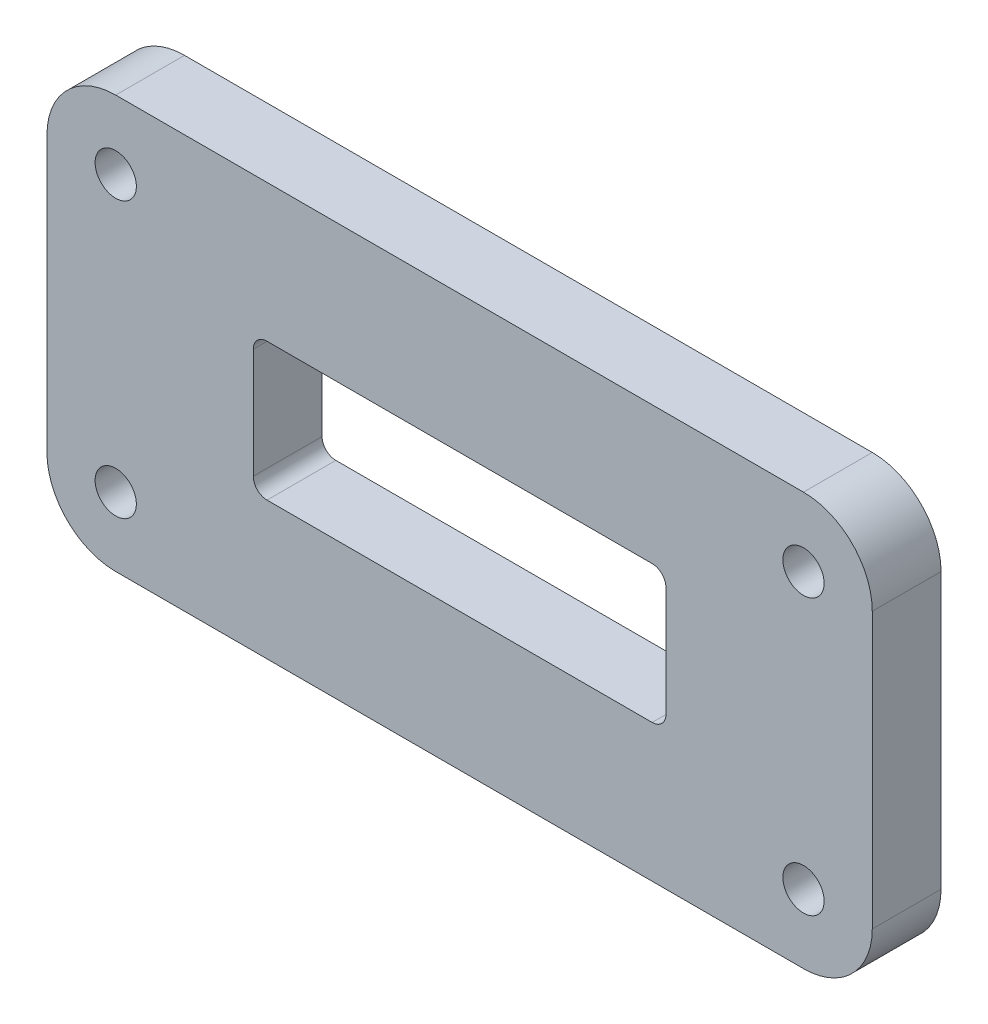
ISO-10303-21;
HEADER;
FILE_DESCRIPTION(('STEP AP214'),'2;1');
FILE_NAME('part.step','',(''),(''),'','','');
FILE_SCHEMA(('AUTOMOTIVE_DESIGN { 1 0 10303 214 1 1 1 1 }'));
ENDSEC;
DATA;
#1=APPLICATION_CONTEXT('core data for automotive mechanical design processes');
#2=APPLICATION_PROTOCOL_DEFINITION('international standard','automotive_design',2000,#1);
#3=PRODUCT_CONTEXT('',#1,'mechanical');
#4=PRODUCT('Part','Part','',(#3));
#5=PRODUCT_RELATED_PRODUCT_CATEGORY('part','',(#4));
#6=PRODUCT_DEFINITION_FORMATION('','',#4);
#7=PRODUCT_DEFINITION_CONTEXT('part definition',#1,'design');
#8=PRODUCT_DEFINITION('design','',#6,#7);
#9=PRODUCT_DEFINITION_SHAPE('','',#8);
#10=(LENGTH_UNIT() NAMED_UNIT(*) SI_UNIT(.MILLI.,.METRE.));
#11=(NAMED_UNIT(*) PLANE_ANGLE_UNIT() SI_UNIT($,.RADIAN.));
#12=(NAMED_UNIT(*) SI_UNIT($,.STERADIAN.) SOLID_ANGLE_UNIT());
#13=UNCERTAINTY_MEASURE_WITH_UNIT(LENGTH_MEASURE(1.E-05),#10,'distance_accuracy_value','');
#14=(GEOMETRIC_REPRESENTATION_CONTEXT(3) GLOBAL_UNCERTAINTY_ASSIGNED_CONTEXT((#13)) GLOBAL_UNIT_ASSIGNED_CONTEXT((#10,
#11,#12)) REPRESENTATION_CONTEXT('',''));
#15=CARTESIAN_POINT('',(0.,0.,0.));
#16=DIRECTION('',(0.,0.,1.));
#17=DIRECTION('',(1.,0.,0.));
#18=AXIS2_PLACEMENT_3D('',#15,#16,#17);
#19=CARTESIAN_POINT('',(25.,10.,5.));
#20=DIRECTION('',(0.,0.,1.));
#21=DIRECTION('',(1.,0.,0.));
#22=AXIS2_PLACEMENT_3D('',#19,#20,#21);
#23=PLANE('',#22);
#24=CARTESIAN_POINT('',(25.,-10.,5.));
#25=DIRECTION('',(0.,0.,1.));
#26=DIRECTION('',(1.,0.,0.));
#27=AXIS2_PLACEMENT_3D('',#24,#25,#26);
#28=CIRCLE('',#27,1.5);
#29=CARTESIAN_POINT('',(26.5,-10.,5.));
#30=VERTEX_POINT('',#29);
#31=EDGE_CURVE('E389',#30,#30,#28,.T.);
#32=ORIENTED_EDGE('',*,*,#31,.F.);
#33=EDGE_LOOP('',(#32));
#34=FACE_BOUND('',#33,.T.);
#35=CARTESIAN_POINT('',(-25.,9.99999999999999,5.));
#36=DIRECTION('',(0.,0.,1.));
#37=DIRECTION('',(1.,0.,0.));
#38=AXIS2_PLACEMENT_3D('',#35,#36,#37);
#39=CIRCLE('',#38,1.5);
#40=CARTESIAN_POINT('',(-23.5,9.99999999999999,5.));
#41=VERTEX_POINT('',#40);
#42=EDGE_CURVE('E184',#41,#41,#39,.T.);
#43=ORIENTED_EDGE('',*,*,#42,.F.);
#44=EDGE_LOOP('',(#43));
#45=FACE_BOUND('',#44,.T.);
#46=CARTESIAN_POINT('',(25.,10.,5.));
#47=DIRECTION('',(0.,0.,1.));
#48=DIRECTION('',(1.,0.,0.));
#49=AXIS2_PLACEMENT_3D('',#46,#47,#48);
#50=CIRCLE('',#49,4.99999999999999);
#51=CARTESIAN_POINT('',(30.,10.,5.));
#52=VERTEX_POINT('',#51);
#53=CARTESIAN_POINT('',(25.,15.,5.));
#54=VERTEX_POINT('',#53);
#55=EDGE_CURVE('E214',#52,#54,#50,.T.);
#56=ORIENTED_EDGE('',*,*,#55,.T.);
#57=DIRECTION('',(-1.,0.,0.));
#58=VECTOR('',#57,1.);
#59=CARTESIAN_POINT('',(25.,15.,5.));
#60=LINE('',#59,#58);
#61=CARTESIAN_POINT('',(-25.,15.,5.));
#62=VERTEX_POINT('',#61);
#63=EDGE_CURVE('E217',#54,#62,#60,.T.);
#64=ORIENTED_EDGE('',*,*,#63,.T.);
#65=CARTESIAN_POINT('',(-25.,9.99999999999999,5.));
#66=DIRECTION('',(0.,0.,1.));
#67=DIRECTION('',(1.,0.,0.));
#68=AXIS2_PLACEMENT_3D('',#65,#66,#67);
#69=CIRCLE('',#68,5.);
#70=CARTESIAN_POINT('',(-30.,9.99999999999999,5.));
#71=VERTEX_POINT('',#70);
#72=EDGE_CURVE('E220',#62,#71,#69,.T.);
#73=ORIENTED_EDGE('',*,*,#72,.T.);
#74=DIRECTION('',(0.,-1.,0.));
#75=VECTOR('',#74,1.);
#76=CARTESIAN_POINT('',(-30.,-10.,5.));
#77=LINE('',#76,#75);
#78=CARTESIAN_POINT('',(-30.,-10.,5.));
#79=VERTEX_POINT('',#78);
#80=EDGE_CURVE('E222',#71,#79,#77,.T.);
#81=ORIENTED_EDGE('',*,*,#80,.T.);
#82=CARTESIAN_POINT('',(-25.,-10.,5.));
#83=DIRECTION('',(0.,0.,1.));
#84=DIRECTION('',(1.,0.,0.));
#85=AXIS2_PLACEMENT_3D('',#82,#83,#84);
#86=CIRCLE('',#85,5.);
#87=CARTESIAN_POINT('',(-25.,-15.,5.));
#88=VERTEX_POINT('',#87);
#89=EDGE_CURVE('E224',#79,#88,#86,.T.);
#90=ORIENTED_EDGE('',*,*,#89,.T.);
#91=DIRECTION('',(1.,0.,0.));
#92=VECTOR('',#91,1.);
#93=CARTESIAN_POINT('',(25.,-15.,5.));
#94=LINE('',#93,#92);
#95=CARTESIAN_POINT('',(25.,-15.,5.));
#96=VERTEX_POINT('',#95);
#97=EDGE_CURVE('E226',#88,#96,#94,.T.);
#98=ORIENTED_EDGE('',*,*,#97,.T.);
#99=CARTESIAN_POINT('',(25.,-10.,5.));
#100=DIRECTION('',(0.,0.,1.));
#101=DIRECTION('',(1.,0.,0.));
#102=AXIS2_PLACEMENT_3D('',#99,#100,#101);
#103=CIRCLE('',#102,4.99999999999999);
#104=CARTESIAN_POINT('',(30.,-10.,5.));
#105=VERTEX_POINT('',#104);
#106=EDGE_CURVE('E228',#96,#105,#103,.T.);
#107=ORIENTED_EDGE('',*,*,#106,.T.);
#108=DIRECTION('',(0.,1.,0.));
#109=VECTOR('',#108,1.);
#110=CARTESIAN_POINT('',(30.,-10.,5.));
#111=LINE('',#110,#109);
#112=EDGE_CURVE('E230',#105,#52,#111,.T.);
#113=ORIENTED_EDGE('',*,*,#112,.T.);
#114=EDGE_LOOP('',(#56,#64,#73,#81,#90,#98,#107,#113));
#115=FACE_BOUND('',#114,.T.);
#116=DIRECTION('',(1.,0.,0.));
#117=VECTOR('',#116,1.);
#118=CARTESIAN_POINT('',(14.,-5.,5.));
#119=LINE('',#118,#117);
#120=CARTESIAN_POINT('',(-14.,-5.,5.));
#121=VERTEX_POINT('',#120);
#122=CARTESIAN_POINT('',(14.,-5.,5.));
#123=VERTEX_POINT('',#122);
#124=EDGE_CURVE('E154',#121,#123,#119,.T.);
#125=ORIENTED_EDGE('',*,*,#124,.F.);
#126=CARTESIAN_POINT('',(-14.,-4.,5.));
#127=DIRECTION('',(0.,0.,1.));
#128=DIRECTION('',(1.,0.,0.));
#129=AXIS2_PLACEMENT_3D('',#126,#127,#128);
#130=CIRCLE('',#129,1.);
#131=CARTESIAN_POINT('',(-15.,-4.,5.));
#132=VERTEX_POINT('',#131);
#133=EDGE_CURVE('E146',#132,#121,#130,.T.);
#134=ORIENTED_EDGE('',*,*,#133,.F.);
#135=DIRECTION('',(0.,-1.,0.));
#136=VECTOR('',#135,1.);
#137=CARTESIAN_POINT('',(-15.,-4.,5.));
#138=LINE('',#137,#136);
#139=CARTESIAN_POINT('',(-15.,4.,5.));
#140=VERTEX_POINT('',#139);
#141=EDGE_CURVE('E181',#140,#132,#138,.T.);
#142=ORIENTED_EDGE('',*,*,#141,.F.);
#143=CARTESIAN_POINT('',(-14.,4.,5.));
#144=DIRECTION('',(0.,0.,1.));
#145=DIRECTION('',(1.,0.,0.));
#146=AXIS2_PLACEMENT_3D('',#143,#144,#145);
#147=CIRCLE('',#146,1.);
#148=CARTESIAN_POINT('',(-14.,5.,5.));
#149=VERTEX_POINT('',#148);
#150=EDGE_CURVE('E179',#149,#140,#147,.T.);
#151=ORIENTED_EDGE('',*,*,#150,.F.);
#152=DIRECTION('',(-1.,0.,0.));
#153=VECTOR('',#152,1.);
#154=CARTESIAN_POINT('',(14.,5.,5.));
#155=LINE('',#154,#153);
#156=CARTESIAN_POINT('',(14.,5.,5.));
#157=VERTEX_POINT('',#156);
#158=EDGE_CURVE('E177',#157,#149,#155,.T.);
#159=ORIENTED_EDGE('',*,*,#158,.F.);
#160=CARTESIAN_POINT('',(14.,4.,5.));
#161=DIRECTION('',(0.,0.,1.));
#162=DIRECTION('',(1.,0.,0.));
#163=AXIS2_PLACEMENT_3D('',#160,#161,#162);
#164=CIRCLE('',#163,1.);
#165=CARTESIAN_POINT('',(15.,4.,5.));
#166=VERTEX_POINT('',#165);
#167=EDGE_CURVE('E175',#166,#157,#164,.T.);
#168=ORIENTED_EDGE('',*,*,#167,.F.);
#169=DIRECTION('',(0.,1.,0.));
#170=VECTOR('',#169,1.);
#171=CARTESIAN_POINT('',(15.,-4.,5.));
#172=LINE('',#171,#170);
#173=CARTESIAN_POINT('',(15.,-4.,5.));
#174=VERTEX_POINT('',#173);
#175=EDGE_CURVE('E170',#174,#166,#172,.T.);
#176=ORIENTED_EDGE('',*,*,#175,.F.);
#177=CARTESIAN_POINT('',(14.,-4.,5.));
#178=DIRECTION('',(0.,0.,1.));
#179=DIRECTION('',(1.,0.,0.));
#180=AXIS2_PLACEMENT_3D('',#177,#178,#179);
#181=CIRCLE('',#180,1.);
#182=EDGE_CURVE('E168',#123,#174,#181,.T.);
#183=ORIENTED_EDGE('',*,*,#182,.F.);
#184=EDGE_LOOP('',(#125,#134,#142,#151,#159,#168,#176,#183));
#185=FACE_BOUND('',#184,.T.);
#186=CARTESIAN_POINT('',(25.,10.,5.));
#187=DIRECTION('',(0.,0.,1.));
#188=DIRECTION('',(1.,0.,0.));
#189=AXIS2_PLACEMENT_3D('',#186,#187,#188);
#190=CIRCLE('',#189,1.5);
#191=CARTESIAN_POINT('',(26.5,10.,5.));
#192=VERTEX_POINT('',#191);
#193=EDGE_CURVE('E395',#192,#192,#190,.T.);
#194=ORIENTED_EDGE('',*,*,#193,.F.);
#195=EDGE_LOOP('',(#194));
#196=FACE_BOUND('',#195,.T.);
#197=CARTESIAN_POINT('',(-25.,-10.,5.));
#198=DIRECTION('',(0.,0.,1.));
#199=DIRECTION('',(1.,0.,0.));
#200=AXIS2_PLACEMENT_3D('',#197,#198,#199);
#201=CIRCLE('',#200,1.5);
#202=CARTESIAN_POINT('',(-23.5,-10.,5.));
#203=VERTEX_POINT('',#202);
#204=EDGE_CURVE('E380',#203,#203,#201,.T.);
#205=ORIENTED_EDGE('',*,*,#204,.F.);
#206=EDGE_LOOP('',(#205));
#207=FACE_BOUND('',#206,.T.);
#208=ADVANCED_FACE('F33',(#34,#45,#115,#185,#196,#207),#23,.T.);
#209=CARTESIAN_POINT('',(25.,10.,0.));
#210=DIRECTION('',(0.,0.,1.));
#211=DIRECTION('',(1.,0.,0.));
#212=AXIS2_PLACEMENT_3D('',#209,#210,#211);
#213=PLANE('',#212);
#214=CARTESIAN_POINT('',(25.,-10.,0.));
#215=DIRECTION('',(0.,0.,1.));
#216=DIRECTION('',(1.,0.,0.));
#217=AXIS2_PLACEMENT_3D('',#214,#215,#216);
#218=CIRCLE('',#217,1.5);
#219=CARTESIAN_POINT('',(26.5,-10.,0.));
#220=VERTEX_POINT('',#219);
#221=EDGE_CURVE('E386',#220,#220,#218,.T.);
#222=ORIENTED_EDGE('',*,*,#221,.T.);
#223=EDGE_LOOP('',(#222));
#224=FACE_BOUND('',#223,.T.);
#225=CARTESIAN_POINT('',(-25.,9.99999999999999,0.));
#226=DIRECTION('',(0.,0.,1.));
#227=DIRECTION('',(1.,0.,0.));
#228=AXIS2_PLACEMENT_3D('',#225,#226,#227);
#229=CIRCLE('',#228,1.5);
#230=CARTESIAN_POINT('',(-23.5,9.99999999999999,0.));
#231=VERTEX_POINT('',#230);
#232=EDGE_CURVE('E398',#231,#231,#229,.T.);
#233=ORIENTED_EDGE('',*,*,#232,.T.);
#234=EDGE_LOOP('',(#233));
#235=FACE_BOUND('',#234,.T.);
#236=CARTESIAN_POINT('',(25.,10.,0.));
#237=DIRECTION('',(0.,0.,1.));
#238=DIRECTION('',(1.,0.,0.));
#239=AXIS2_PLACEMENT_3D('',#236,#237,#238);
#240=CIRCLE('',#239,4.99999999999999);
#241=CARTESIAN_POINT('',(30.,10.,0.));
#242=VERTEX_POINT('',#241);
#243=CARTESIAN_POINT('',(25.,15.,0.));
#244=VERTEX_POINT('',#243);
#245=EDGE_CURVE('E162',#242,#244,#240,.T.);
#246=ORIENTED_EDGE('',*,*,#245,.F.);
#247=DIRECTION('',(0.,1.,0.));
#248=VECTOR('',#247,1.);
#249=CARTESIAN_POINT('',(30.,-10.,0.));
#250=LINE('',#249,#248);
#251=CARTESIAN_POINT('',(30.,-10.,0.));
#252=VERTEX_POINT('',#251);
#253=EDGE_CURVE('E218',#252,#242,#250,.T.);
#254=ORIENTED_EDGE('',*,*,#253,.F.);
#255=CARTESIAN_POINT('',(25.,-10.,0.));
#256=DIRECTION('',(0.,0.,1.));
#257=DIRECTION('',(1.,0.,0.));
#258=AXIS2_PLACEMENT_3D('',#255,#256,#257);
#259=CIRCLE('',#258,4.99999999999999);
#260=CARTESIAN_POINT('',(25.,-15.,0.));
#261=VERTEX_POINT('',#260);
#262=EDGE_CURVE('E245',#261,#252,#259,.T.);
#263=ORIENTED_EDGE('',*,*,#262,.F.);
#264=DIRECTION('',(1.,0.,0.));
#265=VECTOR('',#264,1.);
#266=CARTESIAN_POINT('',(25.,-15.,0.));
#267=LINE('',#266,#265);
#268=CARTESIAN_POINT('',(-25.,-15.,0.));
#269=VERTEX_POINT('',#268);
#270=EDGE_CURVE('E243',#269,#261,#267,.T.);
#271=ORIENTED_EDGE('',*,*,#270,.F.);
#272=CARTESIAN_POINT('',(-25.,-10.,0.));
#273=DIRECTION('',(0.,0.,1.));
#274=DIRECTION('',(1.,0.,0.));
#275=AXIS2_PLACEMENT_3D('',#272,#273,#274);
#276=CIRCLE('',#275,5.);
#277=CARTESIAN_POINT('',(-30.,-10.,0.));
#278=VERTEX_POINT('',#277);
#279=EDGE_CURVE('E241',#278,#269,#276,.T.);
#280=ORIENTED_EDGE('',*,*,#279,.F.);
#281=DIRECTION('',(0.,-1.,0.));
#282=VECTOR('',#281,1.);
#283=CARTESIAN_POINT('',(-30.,-10.,0.));
#284=LINE('',#283,#282);
#285=CARTESIAN_POINT('',(-30.,9.99999999999999,0.));
#286=VERTEX_POINT('',#285);
#287=EDGE_CURVE('E239',#286,#278,#284,.T.);
#288=ORIENTED_EDGE('',*,*,#287,.F.);
#289=CARTESIAN_POINT('',(-25.,9.99999999999999,0.));
#290=DIRECTION('',(0.,0.,1.));
#291=DIRECTION('',(1.,0.,0.));
#292=AXIS2_PLACEMENT_3D('',#289,#290,#291);
#293=CIRCLE('',#292,5.);
#294=CARTESIAN_POINT('',(-25.,15.,0.));
#295=VERTEX_POINT('',#294);
#296=EDGE_CURVE('E237',#295,#286,#293,.T.);
#297=ORIENTED_EDGE('',*,*,#296,.F.);
#298=DIRECTION('',(-1.,0.,0.));
#299=VECTOR('',#298,1.);
#300=CARTESIAN_POINT('',(25.,15.,0.));
#301=LINE('',#300,#299);
#302=EDGE_CURVE('E235',#244,#295,#301,.T.);
#303=ORIENTED_EDGE('',*,*,#302,.F.);
#304=EDGE_LOOP('',(#246,#254,#263,#271,#280,#288,#297,#303));
#305=FACE_BOUND('',#304,.T.);
#306=CARTESIAN_POINT('',(-14.,-4.,0.));
#307=DIRECTION('',(0.,0.,1.));
#308=DIRECTION('',(1.,0.,0.));
#309=AXIS2_PLACEMENT_3D('',#306,#307,#308);
#310=CIRCLE('',#309,1.);
#311=CARTESIAN_POINT('',(-15.,-4.,0.));
#312=VERTEX_POINT('',#311);
#313=CARTESIAN_POINT('',(-14.,-5.,0.));
#314=VERTEX_POINT('',#313);
#315=EDGE_CURVE('E56',#312,#314,#310,.T.);
#316=ORIENTED_EDGE('',*,*,#315,.T.);
#317=DIRECTION('',(1.,0.,0.));
#318=VECTOR('',#317,1.);
#319=CARTESIAN_POINT('',(14.,-5.,0.));
#320=LINE('',#319,#318);
#321=CARTESIAN_POINT('',(14.,-5.,0.));
#322=VERTEX_POINT('',#321);
#323=EDGE_CURVE('E161',#314,#322,#320,.T.);
#324=ORIENTED_EDGE('',*,*,#323,.T.);
#325=CARTESIAN_POINT('',(14.,-4.,0.));
#326=DIRECTION('',(0.,0.,1.));
#327=DIRECTION('',(1.,0.,0.));
#328=AXIS2_PLACEMENT_3D('',#325,#326,#327);
#329=CIRCLE('',#328,1.);
#330=CARTESIAN_POINT('',(15.,-4.,0.));
#331=VERTEX_POINT('',#330);
#332=EDGE_CURVE('E186',#322,#331,#329,.T.);
#333=ORIENTED_EDGE('',*,*,#332,.T.);
#334=DIRECTION('',(0.,1.,0.));
#335=VECTOR('',#334,1.);
#336=CARTESIAN_POINT('',(15.,-4.,0.));
#337=LINE('',#336,#335);
#338=CARTESIAN_POINT('',(15.,4.,0.));
#339=VERTEX_POINT('',#338);
#340=EDGE_CURVE('E189',#331,#339,#337,.T.);
#341=ORIENTED_EDGE('',*,*,#340,.T.);
#342=CARTESIAN_POINT('',(14.,4.,0.));
#343=DIRECTION('',(0.,0.,1.));
#344=DIRECTION('',(1.,0.,0.));
#345=AXIS2_PLACEMENT_3D('',#342,#343,#344);
#346=CIRCLE('',#345,1.);
#347=CARTESIAN_POINT('',(14.,5.,0.));
#348=VERTEX_POINT('',#347);
#349=EDGE_CURVE('E192',#339,#348,#346,.T.);
#350=ORIENTED_EDGE('',*,*,#349,.T.);
#351=DIRECTION('',(-1.,0.,0.));
#352=VECTOR('',#351,1.);
#353=CARTESIAN_POINT('',(14.,5.,0.));
#354=LINE('',#353,#352);
#355=CARTESIAN_POINT('',(-14.,5.,0.));
#356=VERTEX_POINT('',#355);
#357=EDGE_CURVE('E195',#348,#356,#354,.T.);
#358=ORIENTED_EDGE('',*,*,#357,.T.);
#359=CARTESIAN_POINT('',(-14.,4.,0.));
#360=DIRECTION('',(0.,0.,1.));
#361=DIRECTION('',(1.,0.,0.));
#362=AXIS2_PLACEMENT_3D('',#359,#360,#361);
#363=CIRCLE('',#362,1.);
#364=CARTESIAN_POINT('',(-15.,4.,0.));
#365=VERTEX_POINT('',#364);
#366=EDGE_CURVE('E198',#356,#365,#363,.T.);
#367=ORIENTED_EDGE('',*,*,#366,.T.);
#368=DIRECTION('',(0.,-1.,0.));
#369=VECTOR('',#368,1.);
#370=CARTESIAN_POINT('',(-15.,-4.,0.));
#371=LINE('',#370,#369);
#372=EDGE_CURVE('E155',#365,#312,#371,.T.);
#373=ORIENTED_EDGE('',*,*,#372,.T.);
#374=EDGE_LOOP('',(#316,#324,#333,#341,#350,#358,#367,#373));
#375=FACE_BOUND('',#374,.T.);
#376=CARTESIAN_POINT('',(25.,10.,0.));
#377=DIRECTION('',(0.,0.,1.));
#378=DIRECTION('',(1.,0.,0.));
#379=AXIS2_PLACEMENT_3D('',#376,#377,#378);
#380=CIRCLE('',#379,1.5);
#381=CARTESIAN_POINT('',(26.5,10.,0.));
#382=VERTEX_POINT('',#381);
#383=EDGE_CURVE('E392',#382,#382,#380,.T.);
#384=ORIENTED_EDGE('',*,*,#383,.T.);
#385=EDGE_LOOP('',(#384));
#386=FACE_BOUND('',#385,.T.);
#387=CARTESIAN_POINT('',(-25.,-10.,0.));
#388=DIRECTION('',(0.,0.,1.));
#389=DIRECTION('',(1.,0.,0.));
#390=AXIS2_PLACEMENT_3D('',#387,#388,#389);
#391=CIRCLE('',#390,1.5);
#392=CARTESIAN_POINT('',(-23.5,-10.,0.));
#393=VERTEX_POINT('',#392);
#394=EDGE_CURVE('E383',#393,#393,#391,.T.);
#395=ORIENTED_EDGE('',*,*,#394,.T.);
#396=EDGE_LOOP('',(#395));
#397=FACE_BOUND('',#396,.T.);
#398=ADVANCED_FACE('F275',(#224,#235,#305,#375,#386,#397),#213,.F.);
#399=CARTESIAN_POINT('',(25.,10.,5.));
#400=DIRECTION('',(0.,0.,-1.));
#401=DIRECTION('',(-1.,0.,0.));
#402=AXIS2_PLACEMENT_3D('',#399,#400,#401);
#403=CYLINDRICAL_SURFACE('',#402,4.99999999999999);
#404=ORIENTED_EDGE('',*,*,#245,.T.);
#405=DIRECTION('',(0.,0.,-1.));
#406=VECTOR('',#405,1.);
#407=CARTESIAN_POINT('',(25.,15.,5.));
#408=LINE('',#407,#406);
#409=EDGE_CURVE('E11',#54,#244,#408,.T.);
#410=ORIENTED_EDGE('',*,*,#409,.F.);
#411=ORIENTED_EDGE('',*,*,#55,.F.);
#412=DIRECTION('',(0.,0.,-1.));
#413=VECTOR('',#412,1.);
#414=CARTESIAN_POINT('',(30.,10.,5.));
#415=LINE('',#414,#413);
#416=EDGE_CURVE('E232',#52,#242,#415,.T.);
#417=ORIENTED_EDGE('',*,*,#416,.T.);
#418=EDGE_LOOP('',(#404,#410,#411,#417));
#419=FACE_BOUND('',#418,.T.);
#420=ADVANCED_FACE('F35',(#419),#403,.T.);
#421=CARTESIAN_POINT('',(25.,15.,5.));
#422=DIRECTION('',(0.,-1.,0.));
#423=DIRECTION('',(1.,0.,0.));
#424=AXIS2_PLACEMENT_3D('',#421,#422,#423);
#425=PLANE('',#424);
#426=ORIENTED_EDGE('',*,*,#302,.T.);
#427=DIRECTION('',(0.,0.,-1.));
#428=VECTOR('',#427,1.);
#429=CARTESIAN_POINT('',(-25.,15.,5.));
#430=LINE('',#429,#428);
#431=EDGE_CURVE('E41',#62,#295,#430,.T.);
#432=ORIENTED_EDGE('',*,*,#431,.F.);
#433=ORIENTED_EDGE('',*,*,#63,.F.);
#434=ORIENTED_EDGE('',*,*,#409,.T.);
#435=EDGE_LOOP('',(#426,#432,#433,#434));
#436=FACE_BOUND('',#435,.T.);
#437=ADVANCED_FACE('F292',(#436),#425,.F.);
#438=CARTESIAN_POINT('',(-25.,9.99999999999999,5.));
#439=DIRECTION('',(0.,0.,-1.));
#440=DIRECTION('',(-1.,0.,0.));
#441=AXIS2_PLACEMENT_3D('',#438,#439,#440);
#442=CYLINDRICAL_SURFACE('',#441,5.);
#443=ORIENTED_EDGE('',*,*,#296,.T.);
#444=DIRECTION('',(0.,0.,-1.));
#445=VECTOR('',#444,1.);
#446=CARTESIAN_POINT('',(-30.,9.99999999999999,5.));
#447=LINE('',#446,#445);
#448=EDGE_CURVE('E262',#71,#286,#447,.T.);
#449=ORIENTED_EDGE('',*,*,#448,.F.);
#450=ORIENTED_EDGE('',*,*,#72,.F.);
#451=ORIENTED_EDGE('',*,*,#431,.T.);
#452=EDGE_LOOP('',(#443,#449,#450,#451));
#453=FACE_BOUND('',#452,.T.);
#454=ADVANCED_FACE('F269',(#453),#442,.T.);
#455=CARTESIAN_POINT('',(-30.,-10.,5.));
#456=DIRECTION('',(1.,0.,0.));
#457=DIRECTION('',(0.,1.,0.));
#458=AXIS2_PLACEMENT_3D('',#455,#456,#457);
#459=PLANE('',#458);
#460=ORIENTED_EDGE('',*,*,#287,.T.);
#461=DIRECTION('',(0.,0.,-1.));
#462=VECTOR('',#461,1.);
#463=CARTESIAN_POINT('',(-30.,-10.,5.));
#464=LINE('',#463,#462);
#465=EDGE_CURVE('E259',#79,#278,#464,.T.);
#466=ORIENTED_EDGE('',*,*,#465,.F.);
#467=ORIENTED_EDGE('',*,*,#80,.F.);
#468=ORIENTED_EDGE('',*,*,#448,.T.);
#469=EDGE_LOOP('',(#460,#466,#467,#468));
#470=FACE_BOUND('',#469,.T.);
#471=ADVANCED_FACE('F281',(#470),#459,.F.);
#472=CARTESIAN_POINT('',(-25.,-10.,5.));
#473=DIRECTION('',(0.,0.,-1.));
#474=DIRECTION('',(-1.,0.,0.));
#475=AXIS2_PLACEMENT_3D('',#472,#473,#474);
#476=CYLINDRICAL_SURFACE('',#475,5.);
#477=ORIENTED_EDGE('',*,*,#279,.T.);
#478=DIRECTION('',(0.,0.,-1.));
#479=VECTOR('',#478,1.);
#480=CARTESIAN_POINT('',(-25.,-15.,5.));
#481=LINE('',#480,#479);
#482=EDGE_CURVE('E256',#88,#269,#481,.T.);
#483=ORIENTED_EDGE('',*,*,#482,.F.);
#484=ORIENTED_EDGE('',*,*,#89,.F.);
#485=ORIENTED_EDGE('',*,*,#465,.T.);
#486=EDGE_LOOP('',(#477,#483,#484,#485));
#487=FACE_BOUND('',#486,.T.);
#488=ADVANCED_FACE('F285',(#487),#476,.T.);
#489=CARTESIAN_POINT('',(25.,-15.,5.));
#490=DIRECTION('',(0.,1.,0.));
#491=DIRECTION('',(-1.,0.,0.));
#492=AXIS2_PLACEMENT_3D('',#489,#490,#491);
#493=PLANE('',#492);
#494=ORIENTED_EDGE('',*,*,#270,.T.);
#495=DIRECTION('',(0.,0.,-1.));
#496=VECTOR('',#495,1.);
#497=CARTESIAN_POINT('',(25.,-15.,5.));
#498=LINE('',#497,#496);
#499=EDGE_CURVE('E253',#96,#261,#498,.T.);
#500=ORIENTED_EDGE('',*,*,#499,.F.);
#501=ORIENTED_EDGE('',*,*,#97,.F.);
#502=ORIENTED_EDGE('',*,*,#482,.T.);
#503=EDGE_LOOP('',(#494,#500,#501,#502));
#504=FACE_BOUND('',#503,.T.);
#505=ADVANCED_FACE('F305',(#504),#493,.F.);
#506=CARTESIAN_POINT('',(25.,-10.,5.));
#507=DIRECTION('',(0.,0.,-1.));
#508=DIRECTION('',(-1.,0.,0.));
#509=AXIS2_PLACEMENT_3D('',#506,#507,#508);
#510=CYLINDRICAL_SURFACE('',#509,4.99999999999999);
#511=ORIENTED_EDGE('',*,*,#262,.T.);
#512=DIRECTION('',(0.,0.,-1.));
#513=VECTOR('',#512,1.);
#514=CARTESIAN_POINT('',(30.,-10.,5.));
#515=LINE('',#514,#513);
#516=EDGE_CURVE('E250',#105,#252,#515,.T.);
#517=ORIENTED_EDGE('',*,*,#516,.F.);
#518=ORIENTED_EDGE('',*,*,#106,.F.);
#519=ORIENTED_EDGE('',*,*,#499,.T.);
#520=EDGE_LOOP('',(#511,#517,#518,#519));
#521=FACE_BOUND('',#520,.T.);
#522=ADVANCED_FACE('F303',(#521),#510,.T.);
#523=CARTESIAN_POINT('',(30.,-10.,5.));
#524=DIRECTION('',(-1.,0.,0.));
#525=DIRECTION('',(0.,-1.,0.));
#526=AXIS2_PLACEMENT_3D('',#523,#524,#525);
#527=PLANE('',#526);
#528=ORIENTED_EDGE('',*,*,#253,.T.);
#529=ORIENTED_EDGE('',*,*,#416,.F.);
#530=ORIENTED_EDGE('',*,*,#112,.F.);
#531=ORIENTED_EDGE('',*,*,#516,.T.);
#532=EDGE_LOOP('',(#528,#529,#530,#531));
#533=FACE_BOUND('',#532,.T.);
#534=ADVANCED_FACE('F298',(#533),#527,.F.);
#535=CARTESIAN_POINT('',(-14.,-4.,5.));
#536=DIRECTION('',(0.,0.,-1.));
#537=DIRECTION('',(-1.,0.,0.));
#538=AXIS2_PLACEMENT_3D('',#535,#536,#537);
#539=CYLINDRICAL_SURFACE('',#538,1.);
#540=ORIENTED_EDGE('',*,*,#315,.F.);
#541=DIRECTION('',(0.,0.,-1.));
#542=VECTOR('',#541,1.);
#543=CARTESIAN_POINT('',(-15.,-4.,5.));
#544=LINE('',#543,#542);
#545=EDGE_CURVE('E150',#132,#312,#544,.T.);
#546=ORIENTED_EDGE('',*,*,#545,.F.);
#547=ORIENTED_EDGE('',*,*,#133,.T.);
#548=DIRECTION('',(0.,0.,-1.));
#549=VECTOR('',#548,1.);
#550=CARTESIAN_POINT('',(-14.,-5.,5.));
#551=LINE('',#550,#549);
#552=EDGE_CURVE('E149',#121,#314,#551,.T.);
#553=ORIENTED_EDGE('',*,*,#552,.T.);
#554=EDGE_LOOP('',(#540,#546,#547,#553));
#555=FACE_BOUND('',#554,.T.);
#556=ADVANCED_FACE('F148',(#555),#539,.F.);
#557=CARTESIAN_POINT('',(14.,-5.,5.));
#558=DIRECTION('',(0.,1.,0.));
#559=DIRECTION('',(-1.,0.,0.));
#560=AXIS2_PLACEMENT_3D('',#557,#558,#559);
#561=PLANE('',#560);
#562=ORIENTED_EDGE('',*,*,#323,.F.);
#563=ORIENTED_EDGE('',*,*,#552,.F.);
#564=ORIENTED_EDGE('',*,*,#124,.T.);
#565=DIRECTION('',(0.,0.,-1.));
#566=VECTOR('',#565,1.);
#567=CARTESIAN_POINT('',(14.,-5.,5.));
#568=LINE('',#567,#566);
#569=EDGE_CURVE('E163',#123,#322,#568,.T.);
#570=ORIENTED_EDGE('',*,*,#569,.T.);
#571=EDGE_LOOP('',(#562,#563,#564,#570));
#572=FACE_BOUND('',#571,.T.);
#573=ADVANCED_FACE('F158',(#572),#561,.T.);
#574=CARTESIAN_POINT('',(14.,-4.,5.));
#575=DIRECTION('',(0.,0.,-1.));
#576=DIRECTION('',(-1.,0.,0.));
#577=AXIS2_PLACEMENT_3D('',#574,#575,#576);
#578=CYLINDRICAL_SURFACE('',#577,1.);
#579=ORIENTED_EDGE('',*,*,#332,.F.);
#580=ORIENTED_EDGE('',*,*,#569,.F.);
#581=ORIENTED_EDGE('',*,*,#182,.T.);
#582=DIRECTION('',(0.,0.,-1.));
#583=VECTOR('',#582,1.);
#584=CARTESIAN_POINT('',(15.,-4.,5.));
#585=LINE('',#584,#583);
#586=EDGE_CURVE('E211',#174,#331,#585,.T.);
#587=ORIENTED_EDGE('',*,*,#586,.T.);
#588=EDGE_LOOP('',(#579,#580,#581,#587));
#589=FACE_BOUND('',#588,.T.);
#590=ADVANCED_FACE('F334',(#589),#578,.F.);
#591=CARTESIAN_POINT('',(15.,-4.,5.));
#592=DIRECTION('',(-1.,0.,0.));
#593=DIRECTION('',(0.,0.,1.));
#594=AXIS2_PLACEMENT_3D('',#591,#592,#593);
#595=PLANE('',#594);
#596=ORIENTED_EDGE('',*,*,#340,.F.);
#597=ORIENTED_EDGE('',*,*,#586,.F.);
#598=ORIENTED_EDGE('',*,*,#175,.T.);
#599=DIRECTION('',(0.,0.,-1.));
#600=VECTOR('',#599,1.);
#601=CARTESIAN_POINT('',(15.,4.,5.));
#602=LINE('',#601,#600);
#603=EDGE_CURVE('E209',#166,#339,#602,.T.);
#604=ORIENTED_EDGE('',*,*,#603,.T.);
#605=EDGE_LOOP('',(#596,#597,#598,#604));
#606=FACE_BOUND('',#605,.T.);
#607=ADVANCED_FACE('F338',(#606),#595,.T.);
#608=CARTESIAN_POINT('',(14.,4.,5.));
#609=DIRECTION('',(0.,0.,-1.));
#610=DIRECTION('',(-1.,0.,0.));
#611=AXIS2_PLACEMENT_3D('',#608,#609,#610);
#612=CYLINDRICAL_SURFACE('',#611,1.);
#613=ORIENTED_EDGE('',*,*,#349,.F.);
#614=ORIENTED_EDGE('',*,*,#603,.F.);
#615=ORIENTED_EDGE('',*,*,#167,.T.);
#616=DIRECTION('',(0.,0.,-1.));
#617=VECTOR('',#616,1.);
#618=CARTESIAN_POINT('',(14.,5.,5.));
#619=LINE('',#618,#617);
#620=EDGE_CURVE('E207',#157,#348,#619,.T.);
#621=ORIENTED_EDGE('',*,*,#620,.T.);
#622=EDGE_LOOP('',(#613,#614,#615,#621));
#623=FACE_BOUND('',#622,.T.);
#624=ADVANCED_FACE('F344',(#623),#612,.F.);
#625=CARTESIAN_POINT('',(14.,5.,5.));
#626=DIRECTION('',(0.,-1.,0.));
#627=DIRECTION('',(1.,0.,0.));
#628=AXIS2_PLACEMENT_3D('',#625,#626,#627);
#629=PLANE('',#628);
#630=ORIENTED_EDGE('',*,*,#357,.F.);
#631=ORIENTED_EDGE('',*,*,#620,.F.);
#632=ORIENTED_EDGE('',*,*,#158,.T.);
#633=DIRECTION('',(0.,0.,-1.));
#634=VECTOR('',#633,1.);
#635=CARTESIAN_POINT('',(-14.,5.,5.));
#636=LINE('',#635,#634);
#637=EDGE_CURVE('E205',#149,#356,#636,.T.);
#638=ORIENTED_EDGE('',*,*,#637,.T.);
#639=EDGE_LOOP('',(#630,#631,#632,#638));
#640=FACE_BOUND('',#639,.T.);
#641=ADVANCED_FACE('F348',(#640),#629,.T.);
#642=CARTESIAN_POINT('',(-14.,4.,5.));
#643=DIRECTION('',(0.,0.,-1.));
#644=DIRECTION('',(-1.,0.,0.));
#645=AXIS2_PLACEMENT_3D('',#642,#643,#644);
#646=CYLINDRICAL_SURFACE('',#645,1.);
#647=ORIENTED_EDGE('',*,*,#366,.F.);
#648=ORIENTED_EDGE('',*,*,#637,.F.);
#649=ORIENTED_EDGE('',*,*,#150,.T.);
#650=DIRECTION('',(0.,0.,-1.));
#651=VECTOR('',#650,1.);
#652=CARTESIAN_POINT('',(-15.,4.,5.));
#653=LINE('',#652,#651);
#654=EDGE_CURVE('E48',#140,#365,#653,.T.);
#655=ORIENTED_EDGE('',*,*,#654,.T.);
#656=EDGE_LOOP('',(#647,#648,#649,#655));
#657=FACE_BOUND('',#656,.T.);
#658=ADVANCED_FACE('F352',(#657),#646,.F.);
#659=CARTESIAN_POINT('',(-15.,-4.,5.));
#660=DIRECTION('',(1.,0.,0.));
#661=DIRECTION('',(0.,0.,-1.));
#662=AXIS2_PLACEMENT_3D('',#659,#660,#661);
#663=PLANE('',#662);
#664=ORIENTED_EDGE('',*,*,#372,.F.);
#665=ORIENTED_EDGE('',*,*,#654,.F.);
#666=ORIENTED_EDGE('',*,*,#141,.T.);
#667=ORIENTED_EDGE('',*,*,#545,.T.);
#668=EDGE_LOOP('',(#664,#665,#666,#667));
#669=FACE_BOUND('',#668,.T.);
#670=ADVANCED_FACE('F356',(#669),#663,.T.);
#671=CARTESIAN_POINT('',(-25.,9.99999999999999,5.));
#672=DIRECTION('',(0.,0.,-1.));
#673=DIRECTION('',(-1.,0.,0.));
#674=AXIS2_PLACEMENT_3D('',#671,#672,#673);
#675=CYLINDRICAL_SURFACE('',#674,1.5);
#676=ORIENTED_EDGE('',*,*,#42,.T.);
#677=EDGE_LOOP('',(#676));
#678=FACE_BOUND('',#677,.T.);
#679=ORIENTED_EDGE('',*,*,#232,.F.);
#680=EDGE_LOOP('',(#679));
#681=FACE_BOUND('',#680,.T.);
#682=ADVANCED_FACE('F360',(#678,#681),#675,.F.);
#683=CARTESIAN_POINT('',(25.,10.,5.));
#684=DIRECTION('',(0.,0.,-1.));
#685=DIRECTION('',(-1.,0.,0.));
#686=AXIS2_PLACEMENT_3D('',#683,#684,#685);
#687=CYLINDRICAL_SURFACE('',#686,1.5);
#688=ORIENTED_EDGE('',*,*,#193,.T.);
#689=EDGE_LOOP('',(#688));
#690=FACE_BOUND('',#689,.T.);
#691=ORIENTED_EDGE('',*,*,#383,.F.);
#692=EDGE_LOOP('',(#691));
#693=FACE_BOUND('',#692,.T.);
#694=ADVANCED_FACE('F363',(#690,#693),#687,.F.);
#695=CARTESIAN_POINT('',(25.,-10.,5.));
#696=DIRECTION('',(0.,0.,-1.));
#697=DIRECTION('',(-1.,0.,0.));
#698=AXIS2_PLACEMENT_3D('',#695,#696,#697);
#699=CYLINDRICAL_SURFACE('',#698,1.5);
#700=ORIENTED_EDGE('',*,*,#31,.T.);
#701=EDGE_LOOP('',(#700));
#702=FACE_BOUND('',#701,.T.);
#703=ORIENTED_EDGE('',*,*,#221,.F.);
#704=EDGE_LOOP('',(#703));
#705=FACE_BOUND('',#704,.T.);
#706=ADVANCED_FACE('F367',(#702,#705),#699,.F.);
#707=CARTESIAN_POINT('',(-25.,-10.,5.));
#708=DIRECTION('',(0.,0.,-1.));
#709=DIRECTION('',(-1.,0.,0.));
#710=AXIS2_PLACEMENT_3D('',#707,#708,#709);
#711=CYLINDRICAL_SURFACE('',#710,1.5);
#712=ORIENTED_EDGE('',*,*,#204,.T.);
#713=EDGE_LOOP('',(#712));
#714=FACE_BOUND('',#713,.T.);
#715=ORIENTED_EDGE('',*,*,#394,.F.);
#716=EDGE_LOOP('',(#715));
#717=FACE_BOUND('',#716,.T.);
#718=ADVANCED_FACE('F371',(#714,#717),#711,.F.);
#719=CLOSED_SHELL('',(#208,#398,#420,#437,#454,#471,#488,#505,#522,#534,#556,#573,#590,#607,
#624,#641,#658,#670,#682,#694,#706,#718));
#720=MANIFOLD_SOLID_BREP('B2',#719);
#721=ADVANCED_BREP_SHAPE_REPRESENTATION('',(#18,#720),#14);
#722=SHAPE_DEFINITION_REPRESENTATION(#9,#721);
ENDSEC;
END-ISO-10303-21;
